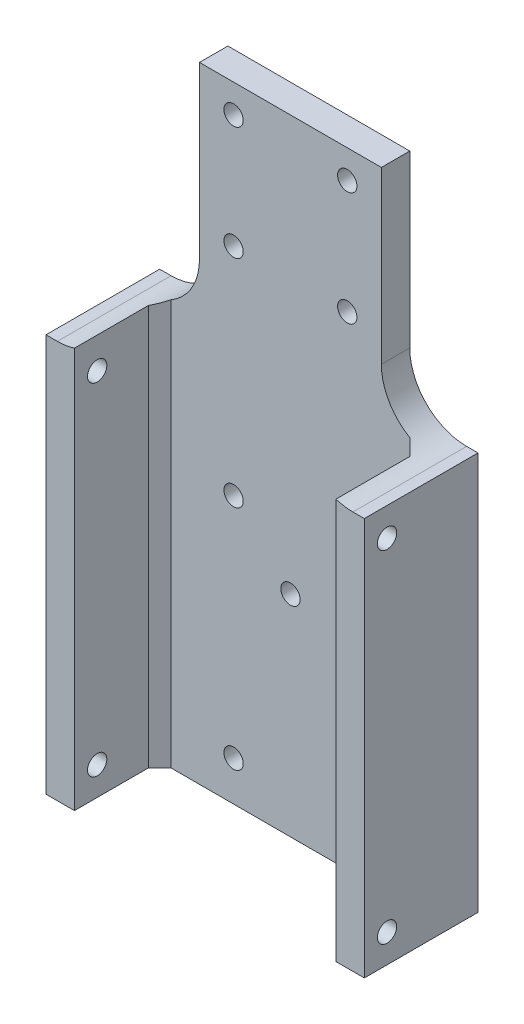
ISO-10303-21;
HEADER;
FILE_DESCRIPTION(('STEP AP214'),'2;1');
FILE_NAME('part.step','',(''),(''),'','','');
FILE_SCHEMA(('AUTOMOTIVE_DESIGN { 1 0 10303 214 1 1 1 1 }'));
ENDSEC;
DATA;
#1=APPLICATION_CONTEXT('core data for automotive mechanical design processes');
#2=APPLICATION_PROTOCOL_DEFINITION('international standard','automotive_design',2000,#1);
#3=PRODUCT_CONTEXT('',#1,'mechanical');
#4=PRODUCT('Part','Part','',(#3));
#5=PRODUCT_RELATED_PRODUCT_CATEGORY('part','',(#4));
#6=PRODUCT_DEFINITION_FORMATION('','',#4);
#7=PRODUCT_DEFINITION_CONTEXT('part definition',#1,'design');
#8=PRODUCT_DEFINITION('design','',#6,#7);
#9=PRODUCT_DEFINITION_SHAPE('','',#8);
#10=(LENGTH_UNIT() NAMED_UNIT(*) SI_UNIT(.MILLI.,.METRE.));
#11=(NAMED_UNIT(*) PLANE_ANGLE_UNIT() SI_UNIT($,.RADIAN.));
#12=(NAMED_UNIT(*) SI_UNIT($,.STERADIAN.) SOLID_ANGLE_UNIT());
#13=UNCERTAINTY_MEASURE_WITH_UNIT(LENGTH_MEASURE(1.E-05),#10,'distance_accuracy_value','');
#14=(GEOMETRIC_REPRESENTATION_CONTEXT(3) GLOBAL_UNCERTAINTY_ASSIGNED_CONTEXT((#13)) GLOBAL_UNIT_ASSIGNED_CONTEXT((#10,
#11,#12)) REPRESENTATION_CONTEXT('',''));
#15=CARTESIAN_POINT('',(0.,0.,0.));
#16=DIRECTION('',(0.,0.,1.));
#17=DIRECTION('',(1.,0.,0.));
#18=AXIS2_PLACEMENT_3D('',#15,#16,#17);
#19=CARTESIAN_POINT('',(-16.,40.,-2.5));
#20=DIRECTION('',(1.,0.,0.));
#21=DIRECTION('',(0.,0.,-1.));
#22=AXIS2_PLACEMENT_3D('',#19,#20,#21);
#23=PLANE('',#22);
#24=DIRECTION('',(0.,-1.,0.));
#25=VECTOR('',#24,1.);
#26=CARTESIAN_POINT('',(-16.,40.,-2.5));
#27=LINE('',#26,#25);
#28=CARTESIAN_POINT('',(-16.,40.,-2.5));
#29=VERTEX_POINT('',#28);
#30=CARTESIAN_POINT('',(-16.,10.,-2.5));
#31=VERTEX_POINT('',#30);
#32=EDGE_CURVE('E251',#29,#31,#27,.T.);
#33=ORIENTED_EDGE('',*,*,#32,.T.);
#34=DIRECTION('',(0.,0.,1.));
#35=VECTOR('',#34,1.);
#36=CARTESIAN_POINT('',(-16.,10.,-2.5));
#37=LINE('',#36,#35);
#38=CARTESIAN_POINT('',(-16.,10.,2.5));
#39=VERTEX_POINT('',#38);
#40=EDGE_CURVE('E262',#31,#39,#37,.T.);
#41=ORIENTED_EDGE('',*,*,#40,.T.);
#42=DIRECTION('',(0.,-1.,0.));
#43=VECTOR('',#42,1.);
#44=CARTESIAN_POINT('',(-16.,40.,2.5));
#45=LINE('',#44,#43);
#46=CARTESIAN_POINT('',(-16.,40.,2.5));
#47=VERTEX_POINT('',#46);
#48=EDGE_CURVE('E259',#47,#39,#45,.T.);
#49=ORIENTED_EDGE('',*,*,#48,.F.);
#50=DIRECTION('',(0.,0.,1.));
#51=VECTOR('',#50,1.);
#52=CARTESIAN_POINT('',(-16.,40.,-2.5));
#53=LINE('',#52,#51);
#54=EDGE_CURVE('E242',#29,#47,#53,.T.);
#55=ORIENTED_EDGE('',*,*,#54,.F.);
#56=EDGE_LOOP('',(#33,#41,#49,#55));
#57=FACE_BOUND('',#56,.T.);
#58=ADVANCED_FACE('F39',(#57),#23,.F.);
#59=CARTESIAN_POINT('',(16.,40.,2.5));
#60=DIRECTION('',(0.,0.,-1.));
#61=DIRECTION('',(-1.,0.,0.));
#62=AXIS2_PLACEMENT_3D('',#59,#60,#61);
#63=PLANE('',#62);
#64=CARTESIAN_POINT('',(9.99999999999997,-23.,2.5));
#65=DIRECTION('',(0.,0.,-1.));
#66=DIRECTION('',(-1.,0.,0.));
#67=AXIS2_PLACEMENT_3D('',#64,#65,#66);
#68=CIRCLE('',#67,1.69999999999999);
#69=CARTESIAN_POINT('',(8.29999999999998,-23.,2.5));
#70=VERTEX_POINT('',#69);
#71=EDGE_CURVE('E272',#70,#70,#68,.T.);
#72=ORIENTED_EDGE('',*,*,#71,.T.);
#73=EDGE_LOOP('',(#72));
#74=FACE_BOUND('',#73,.T.);
#75=CARTESIAN_POINT('',(-10.,-23.,2.5));
#76=DIRECTION('',(0.,0.,-1.));
#77=DIRECTION('',(-1.,0.,0.));
#78=AXIS2_PLACEMENT_3D('',#75,#76,#77);
#79=CIRCLE('',#78,1.69999999999999);
#80=CARTESIAN_POINT('',(-11.7,-23.,2.5));
#81=VERTEX_POINT('',#80);
#82=EDGE_CURVE('E710',#81,#81,#79,.T.);
#83=ORIENTED_EDGE('',*,*,#82,.T.);
#84=EDGE_LOOP('',(#83));
#85=FACE_BOUND('',#84,.T.);
#86=CARTESIAN_POINT('',(0.,-33.,2.5));
#87=DIRECTION('',(0.,0.,-1.));
#88=DIRECTION('',(-1.,0.,0.));
#89=AXIS2_PLACEMENT_3D('',#86,#87,#88);
#90=CIRCLE('',#89,1.69999999999999);
#91=CARTESIAN_POINT('',(-1.70000000000002,-33.,2.5));
#92=VERTEX_POINT('',#91);
#93=EDGE_CURVE('E704',#92,#92,#90,.T.);
#94=ORIENTED_EDGE('',*,*,#93,.T.);
#95=EDGE_LOOP('',(#94));
#96=FACE_BOUND('',#95,.T.);
#97=CARTESIAN_POINT('',(9.99999999999997,-63.,2.5));
#98=DIRECTION('',(0.,0.,-1.));
#99=DIRECTION('',(-1.,0.,0.));
#100=AXIS2_PLACEMENT_3D('',#97,#98,#99);
#101=CIRCLE('',#100,1.69999999999999);
#102=CARTESIAN_POINT('',(8.29999999999998,-63.,2.5));
#103=VERTEX_POINT('',#102);
#104=EDGE_CURVE('E698',#103,#103,#101,.T.);
#105=ORIENTED_EDGE('',*,*,#104,.T.);
#106=EDGE_LOOP('',(#105));
#107=FACE_BOUND('',#106,.T.);
#108=CARTESIAN_POINT('',(-10.,-63.,2.5));
#109=DIRECTION('',(0.,0.,-1.));
#110=DIRECTION('',(-1.,0.,0.));
#111=AXIS2_PLACEMENT_3D('',#108,#109,#110);
#112=CIRCLE('',#111,1.69999999999999);
#113=CARTESIAN_POINT('',(-11.7,-63.,2.5));
#114=VERTEX_POINT('',#113);
#115=EDGE_CURVE('E679',#114,#114,#112,.T.);
#116=ORIENTED_EDGE('',*,*,#115,.T.);
#117=EDGE_LOOP('',(#116));
#118=FACE_BOUND('',#117,.T.);
#119=CARTESIAN_POINT('',(-9.99999999999998,35.,2.5));
#120=DIRECTION('',(0.,0.,1.));
#121=DIRECTION('',(1.,0.,0.));
#122=AXIS2_PLACEMENT_3D('',#119,#120,#121);
#123=CIRCLE('',#122,1.7);
#124=CARTESIAN_POINT('',(-8.29999999999998,35.,2.5));
#125=VERTEX_POINT('',#124);
#126=EDGE_CURVE('E164',#125,#125,#123,.T.);
#127=ORIENTED_EDGE('',*,*,#126,.F.);
#128=EDGE_LOOP('',(#127));
#129=FACE_BOUND('',#128,.T.);
#130=CARTESIAN_POINT('',(10.,35.,2.5));
#131=DIRECTION('',(0.,0.,1.));
#132=DIRECTION('',(1.,0.,0.));
#133=AXIS2_PLACEMENT_3D('',#130,#131,#132);
#134=CIRCLE('',#133,1.7);
#135=CARTESIAN_POINT('',(11.7,35.,2.5));
#136=VERTEX_POINT('',#135);
#137=EDGE_CURVE('E224',#136,#136,#134,.T.);
#138=ORIENTED_EDGE('',*,*,#137,.F.);
#139=EDGE_LOOP('',(#138));
#140=FACE_BOUND('',#139,.T.);
#141=CARTESIAN_POINT('',(9.99999999999998,15.,2.5));
#142=DIRECTION('',(0.,0.,1.));
#143=DIRECTION('',(1.,0.,0.));
#144=AXIS2_PLACEMENT_3D('',#141,#142,#143);
#145=CIRCLE('',#144,1.7);
#146=CARTESIAN_POINT('',(11.7,15.,2.5));
#147=VERTEX_POINT('',#146);
#148=EDGE_CURVE('E230',#147,#147,#145,.T.);
#149=ORIENTED_EDGE('',*,*,#148,.F.);
#150=EDGE_LOOP('',(#149));
#151=FACE_BOUND('',#150,.T.);
#152=CARTESIAN_POINT('',(-9.99999999999998,15.,2.5));
#153=DIRECTION('',(0.,0.,1.));
#154=DIRECTION('',(1.,0.,0.));
#155=AXIS2_PLACEMENT_3D('',#152,#153,#154);
#156=CIRCLE('',#155,1.7);
#157=CARTESIAN_POINT('',(-8.29999999999998,15.,2.5));
#158=VERTEX_POINT('',#157);
#159=EDGE_CURVE('E236',#158,#158,#156,.T.);
#160=ORIENTED_EDGE('',*,*,#159,.F.);
#161=EDGE_LOOP('',(#160));
#162=FACE_BOUND('',#161,.T.);
#163=DIRECTION('',(1.,0.,0.));
#164=VECTOR('',#163,1.);
#165=CARTESIAN_POINT('',(-23.,-70.,2.5));
#166=LINE('',#165,#164);
#167=CARTESIAN_POINT('',(-21.,-70.,2.5));
#168=VERTEX_POINT('',#167);
#169=CARTESIAN_POINT('',(21.,-70.,2.5));
#170=VERTEX_POINT('',#169);
#171=EDGE_CURVE('E165',#168,#170,#166,.T.);
#172=ORIENTED_EDGE('',*,*,#171,.T.);
#173=DIRECTION('',(0.,1.,0.));
#174=VECTOR('',#173,1.);
#175=CARTESIAN_POINT('',(21.,40.,2.5));
#176=LINE('',#175,#174);
#177=CARTESIAN_POINT('',(21.,1.33974596215561,2.5));
#178=VERTEX_POINT('',#177);
#179=EDGE_CURVE('E307',#170,#178,#176,.T.);
#180=ORIENTED_EDGE('',*,*,#179,.T.);
#181=CARTESIAN_POINT('',(26.,10.,2.5));
#182=DIRECTION('',(0.,0.,-1.));
#183=DIRECTION('',(-1.,0.,0.));
#184=AXIS2_PLACEMENT_3D('',#181,#182,#183);
#185=CIRCLE('',#184,10.);
#186=CARTESIAN_POINT('',(16.,10.,2.5));
#187=VERTEX_POINT('',#186);
#188=EDGE_CURVE('E303',#178,#187,#185,.T.);
#189=ORIENTED_EDGE('',*,*,#188,.T.);
#190=DIRECTION('',(0.,-1.,0.));
#191=VECTOR('',#190,1.);
#192=CARTESIAN_POINT('',(16.,40.,2.5));
#193=LINE('',#192,#191);
#194=CARTESIAN_POINT('',(16.,40.,2.5));
#195=VERTEX_POINT('',#194);
#196=EDGE_CURVE('E256',#195,#187,#193,.T.);
#197=ORIENTED_EDGE('',*,*,#196,.F.);
#198=DIRECTION('',(1.,0.,0.));
#199=VECTOR('',#198,1.);
#200=CARTESIAN_POINT('',(16.,40.,2.5));
#201=LINE('',#200,#199);
#202=EDGE_CURVE('E245',#47,#195,#201,.T.);
#203=ORIENTED_EDGE('',*,*,#202,.F.);
#204=ORIENTED_EDGE('',*,*,#48,.T.);
#205=CARTESIAN_POINT('',(-26.,10.,2.5));
#206=DIRECTION('',(0.,0.,-1.));
#207=DIRECTION('',(-1.,0.,0.));
#208=AXIS2_PLACEMENT_3D('',#205,#206,#207);
#209=CIRCLE('',#208,10.);
#210=CARTESIAN_POINT('',(-21.,1.33974596215562,2.5));
#211=VERTEX_POINT('',#210);
#212=EDGE_CURVE('E286',#39,#211,#209,.T.);
#213=ORIENTED_EDGE('',*,*,#212,.T.);
#214=DIRECTION('',(0.,-1.,0.));
#215=VECTOR('',#214,1.);
#216=CARTESIAN_POINT('',(-21.,40.,2.5));
#217=LINE('',#216,#215);
#218=EDGE_CURVE('E305',#211,#168,#217,.T.);
#219=ORIENTED_EDGE('',*,*,#218,.T.);
#220=EDGE_LOOP('',(#172,#180,#189,#197,#203,#204,#213,#219));
#221=FACE_BOUND('',#220,.T.);
#222=ADVANCED_FACE('F324',(#74,#85,#96,#107,#118,#129,#140,#151,#162,#221),#63,.F.);
#223=CARTESIAN_POINT('',(16.,40.,-2.5));
#224=DIRECTION('',(-1.,0.,0.));
#225=DIRECTION('',(0.,0.,1.));
#226=AXIS2_PLACEMENT_3D('',#223,#224,#225);
#227=PLANE('',#226);
#228=ORIENTED_EDGE('',*,*,#196,.T.);
#229=DIRECTION('',(0.,0.,-1.));
#230=VECTOR('',#229,1.);
#231=CARTESIAN_POINT('',(16.,10.,-2.5));
#232=LINE('',#231,#230);
#233=CARTESIAN_POINT('',(16.,10.,-2.5));
#234=VERTEX_POINT('',#233);
#235=EDGE_CURVE('E281',#187,#234,#232,.T.);
#236=ORIENTED_EDGE('',*,*,#235,.T.);
#237=DIRECTION('',(0.,-1.,0.));
#238=VECTOR('',#237,1.);
#239=CARTESIAN_POINT('',(16.,40.,-2.5));
#240=LINE('',#239,#238);
#241=CARTESIAN_POINT('',(16.,40.,-2.5));
#242=VERTEX_POINT('',#241);
#243=EDGE_CURVE('E254',#242,#234,#240,.T.);
#244=ORIENTED_EDGE('',*,*,#243,.F.);
#245=DIRECTION('',(0.,0.,-1.));
#246=VECTOR('',#245,1.);
#247=CARTESIAN_POINT('',(16.,40.,-2.5));
#248=LINE('',#247,#246);
#249=EDGE_CURVE('E247',#195,#242,#248,.T.);
#250=ORIENTED_EDGE('',*,*,#249,.F.);
#251=EDGE_LOOP('',(#228,#236,#244,#250));
#252=FACE_BOUND('',#251,.T.);
#253=ADVANCED_FACE('F344',(#252),#227,.F.);
#254=CARTESIAN_POINT('',(16.,40.,-2.5));
#255=DIRECTION('',(0.,0.,1.));
#256=DIRECTION('',(1.,0.,0.));
#257=AXIS2_PLACEMENT_3D('',#254,#255,#256);
#258=PLANE('',#257);
#259=CARTESIAN_POINT('',(9.99999999999997,-23.,-2.5));
#260=DIRECTION('',(0.,0.,-1.));
#261=DIRECTION('',(-1.,0.,0.));
#262=AXIS2_PLACEMENT_3D('',#259,#260,#261);
#263=CIRCLE('',#262,1.69999999999999);
#264=CARTESIAN_POINT('',(8.29999999999999,-23.,-2.5));
#265=VERTEX_POINT('',#264);
#266=EDGE_CURVE('E276',#265,#265,#263,.T.);
#267=ORIENTED_EDGE('',*,*,#266,.F.);
#268=EDGE_LOOP('',(#267));
#269=FACE_BOUND('',#268,.T.);
#270=CARTESIAN_POINT('',(-10.,-23.,-2.5));
#271=DIRECTION('',(0.,0.,-1.));
#272=DIRECTION('',(-1.,0.,0.));
#273=AXIS2_PLACEMENT_3D('',#270,#271,#272);
#274=CIRCLE('',#273,1.69999999999999);
#275=CARTESIAN_POINT('',(-11.7,-23.,-2.5));
#276=VERTEX_POINT('',#275);
#277=EDGE_CURVE('E275',#276,#276,#274,.T.);
#278=ORIENTED_EDGE('',*,*,#277,.F.);
#279=EDGE_LOOP('',(#278));
#280=FACE_BOUND('',#279,.T.);
#281=CARTESIAN_POINT('',(0.,-33.,-2.5));
#282=DIRECTION('',(0.,0.,-1.));
#283=DIRECTION('',(-1.,0.,0.));
#284=AXIS2_PLACEMENT_3D('',#281,#282,#283);
#285=CIRCLE('',#284,1.69999999999999);
#286=CARTESIAN_POINT('',(-1.70000000000001,-33.,-2.5));
#287=VERTEX_POINT('',#286);
#288=EDGE_CURVE('E707',#287,#287,#285,.T.);
#289=ORIENTED_EDGE('',*,*,#288,.F.);
#290=EDGE_LOOP('',(#289));
#291=FACE_BOUND('',#290,.T.);
#292=CARTESIAN_POINT('',(9.99999999999997,-63.,-2.5));
#293=DIRECTION('',(0.,0.,-1.));
#294=DIRECTION('',(-1.,0.,0.));
#295=AXIS2_PLACEMENT_3D('',#292,#293,#294);
#296=CIRCLE('',#295,1.69999999999999);
#297=CARTESIAN_POINT('',(8.29999999999999,-63.,-2.5));
#298=VERTEX_POINT('',#297);
#299=EDGE_CURVE('E701',#298,#298,#296,.T.);
#300=ORIENTED_EDGE('',*,*,#299,.F.);
#301=EDGE_LOOP('',(#300));
#302=FACE_BOUND('',#301,.T.);
#303=CARTESIAN_POINT('',(-10.,-63.,-2.5));
#304=DIRECTION('',(0.,0.,-1.));
#305=DIRECTION('',(-1.,0.,0.));
#306=AXIS2_PLACEMENT_3D('',#303,#304,#305);
#307=CIRCLE('',#306,1.69999999999999);
#308=CARTESIAN_POINT('',(-11.7,-63.,-2.5));
#309=VERTEX_POINT('',#308);
#310=EDGE_CURVE('E695',#309,#309,#307,.T.);
#311=ORIENTED_EDGE('',*,*,#310,.F.);
#312=EDGE_LOOP('',(#311));
#313=FACE_BOUND('',#312,.T.);
#314=CARTESIAN_POINT('',(-9.99999999999998,35.,-2.5));
#315=DIRECTION('',(0.,0.,1.));
#316=DIRECTION('',(1.,0.,0.));
#317=AXIS2_PLACEMENT_3D('',#314,#315,#316);
#318=CIRCLE('',#317,1.7);
#319=CARTESIAN_POINT('',(-8.29999999999998,35.,-2.5));
#320=VERTEX_POINT('',#319);
#321=EDGE_CURVE('E221',#320,#320,#318,.T.);
#322=ORIENTED_EDGE('',*,*,#321,.T.);
#323=EDGE_LOOP('',(#322));
#324=FACE_BOUND('',#323,.T.);
#325=CARTESIAN_POINT('',(10.,35.,-2.5));
#326=DIRECTION('',(0.,0.,1.));
#327=DIRECTION('',(1.,0.,0.));
#328=AXIS2_PLACEMENT_3D('',#325,#326,#327);
#329=CIRCLE('',#328,1.7);
#330=CARTESIAN_POINT('',(11.7,35.,-2.5));
#331=VERTEX_POINT('',#330);
#332=EDGE_CURVE('E227',#331,#331,#329,.T.);
#333=ORIENTED_EDGE('',*,*,#332,.T.);
#334=EDGE_LOOP('',(#333));
#335=FACE_BOUND('',#334,.T.);
#336=CARTESIAN_POINT('',(9.99999999999998,15.,-2.5));
#337=DIRECTION('',(0.,0.,1.));
#338=DIRECTION('',(1.,0.,0.));
#339=AXIS2_PLACEMENT_3D('',#336,#337,#338);
#340=CIRCLE('',#339,1.7);
#341=CARTESIAN_POINT('',(11.7,15.,-2.5));
#342=VERTEX_POINT('',#341);
#343=EDGE_CURVE('E233',#342,#342,#340,.T.);
#344=ORIENTED_EDGE('',*,*,#343,.T.);
#345=EDGE_LOOP('',(#344));
#346=FACE_BOUND('',#345,.T.);
#347=CARTESIAN_POINT('',(-9.99999999999998,15.,-2.5));
#348=DIRECTION('',(0.,0.,1.));
#349=DIRECTION('',(1.,0.,0.));
#350=AXIS2_PLACEMENT_3D('',#347,#348,#349);
#351=CIRCLE('',#350,1.7);
#352=CARTESIAN_POINT('',(-8.29999999999998,15.,-2.5));
#353=VERTEX_POINT('',#352);
#354=EDGE_CURVE('E239',#353,#353,#351,.T.);
#355=ORIENTED_EDGE('',*,*,#354,.T.);
#356=EDGE_LOOP('',(#355));
#357=FACE_BOUND('',#356,.T.);
#358=ORIENTED_EDGE('',*,*,#243,.T.);
#359=CARTESIAN_POINT('',(26.,10.,-2.5));
#360=DIRECTION('',(0.,0.,1.));
#361=DIRECTION('',(1.,0.,0.));
#362=AXIS2_PLACEMENT_3D('',#359,#360,#361);
#363=CIRCLE('',#362,10.);
#364=CARTESIAN_POINT('',(26.,0.,-2.5));
#365=VERTEX_POINT('',#364);
#366=EDGE_CURVE('E295',#234,#365,#363,.T.);
#367=ORIENTED_EDGE('',*,*,#366,.T.);
#368=DIRECTION('',(-1.,0.,0.));
#369=VECTOR('',#368,1.);
#370=CARTESIAN_POINT('',(-23.,0.,-2.5));
#371=LINE('',#370,#369);
#372=CARTESIAN_POINT('',(28.,0.,-2.5));
#373=VERTEX_POINT('',#372);
#374=EDGE_CURVE('E215',#373,#365,#371,.T.);
#375=ORIENTED_EDGE('',*,*,#374,.F.);
#376=DIRECTION('',(0.,1.,0.));
#377=VECTOR('',#376,1.);
#378=CARTESIAN_POINT('',(28.,-70.,-2.5));
#379=LINE('',#378,#377);
#380=CARTESIAN_POINT('',(28.,-70.,-2.5));
#381=VERTEX_POINT('',#380);
#382=EDGE_CURVE('E160',#381,#373,#379,.T.);
#383=ORIENTED_EDGE('',*,*,#382,.F.);
#384=DIRECTION('',(-1.,0.,0.));
#385=VECTOR('',#384,1.);
#386=CARTESIAN_POINT('',(-23.,-70.,-2.5));
#387=LINE('',#386,#385);
#388=CARTESIAN_POINT('',(-28.,-70.,-2.5));
#389=VERTEX_POINT('',#388);
#390=EDGE_CURVE('E152',#381,#389,#387,.T.);
#391=ORIENTED_EDGE('',*,*,#390,.T.);
#392=DIRECTION('',(0.,1.,0.));
#393=VECTOR('',#392,1.);
#394=CARTESIAN_POINT('',(-28.,-70.,-2.5));
#395=LINE('',#394,#393);
#396=CARTESIAN_POINT('',(-28.,0.,-2.5));
#397=VERTEX_POINT('',#396);
#398=EDGE_CURVE('E157',#389,#397,#395,.T.);
#399=ORIENTED_EDGE('',*,*,#398,.T.);
#400=CARTESIAN_POINT('',(-26.,0.,-2.5));
#401=VERTEX_POINT('',#400);
#402=EDGE_CURVE('E209',#401,#397,#371,.T.);
#403=ORIENTED_EDGE('',*,*,#402,.F.);
#404=CARTESIAN_POINT('',(-26.,10.,-2.5));
#405=DIRECTION('',(0.,0.,1.));
#406=DIRECTION('',(1.,0.,0.));
#407=AXIS2_PLACEMENT_3D('',#404,#405,#406);
#408=CIRCLE('',#407,10.);
#409=EDGE_CURVE('E293',#401,#31,#408,.T.);
#410=ORIENTED_EDGE('',*,*,#409,.T.);
#411=ORIENTED_EDGE('',*,*,#32,.F.);
#412=DIRECTION('',(-1.,0.,0.));
#413=VECTOR('',#412,1.);
#414=CARTESIAN_POINT('',(16.,40.,-2.5));
#415=LINE('',#414,#413);
#416=EDGE_CURVE('E249',#242,#29,#415,.T.);
#417=ORIENTED_EDGE('',*,*,#416,.F.);
#418=EDGE_LOOP('',(#358,#367,#375,#383,#391,#399,#403,#410,#411,#417));
#419=FACE_BOUND('',#418,.T.);
#420=ADVANCED_FACE('F155',(#269,#280,#291,#302,#313,#324,#335,#346,#357,#419),#258,.F.);
#421=CARTESIAN_POINT('',(0.,40.,0.));
#422=DIRECTION('',(0.,-1.,0.));
#423=DIRECTION('',(0.,0.,-1.));
#424=AXIS2_PLACEMENT_3D('',#421,#422,#423);
#425=PLANE('',#424);
#426=ORIENTED_EDGE('',*,*,#54,.T.);
#427=ORIENTED_EDGE('',*,*,#202,.T.);
#428=ORIENTED_EDGE('',*,*,#249,.T.);
#429=ORIENTED_EDGE('',*,*,#416,.T.);
#430=EDGE_LOOP('',(#426,#427,#428,#429));
#431=FACE_BOUND('',#430,.T.);
#432=ADVANCED_FACE('F340',(#431),#425,.F.);
#433=CARTESIAN_POINT('',(-9.99999999999998,15.,2.5));
#434=DIRECTION('',(0.,0.,1.));
#435=DIRECTION('',(1.,0.,0.));
#436=AXIS2_PLACEMENT_3D('',#433,#434,#435);
#437=CYLINDRICAL_SURFACE('',#436,1.7);
#438=ORIENTED_EDGE('',*,*,#354,.F.);
#439=EDGE_LOOP('',(#438));
#440=FACE_BOUND('',#439,.T.);
#441=ORIENTED_EDGE('',*,*,#159,.T.);
#442=EDGE_LOOP('',(#441));
#443=FACE_BOUND('',#442,.T.);
#444=ADVANCED_FACE('F454',(#440,#443),#437,.F.);
#445=CARTESIAN_POINT('',(9.99999999999998,15.,2.5));
#446=DIRECTION('',(0.,0.,1.));
#447=DIRECTION('',(1.,0.,0.));
#448=AXIS2_PLACEMENT_3D('',#445,#446,#447);
#449=CYLINDRICAL_SURFACE('',#448,1.7);
#450=ORIENTED_EDGE('',*,*,#343,.F.);
#451=EDGE_LOOP('',(#450));
#452=FACE_BOUND('',#451,.T.);
#453=ORIENTED_EDGE('',*,*,#148,.T.);
#454=EDGE_LOOP('',(#453));
#455=FACE_BOUND('',#454,.T.);
#456=ADVANCED_FACE('F450',(#452,#455),#449,.F.);
#457=CARTESIAN_POINT('',(10.,35.,2.5));
#458=DIRECTION('',(0.,0.,1.));
#459=DIRECTION('',(1.,0.,0.));
#460=AXIS2_PLACEMENT_3D('',#457,#458,#459);
#461=CYLINDRICAL_SURFACE('',#460,1.7);
#462=ORIENTED_EDGE('',*,*,#332,.F.);
#463=EDGE_LOOP('',(#462));
#464=FACE_BOUND('',#463,.T.);
#465=ORIENTED_EDGE('',*,*,#137,.T.);
#466=EDGE_LOOP('',(#465));
#467=FACE_BOUND('',#466,.T.);
#468=ADVANCED_FACE('F446',(#464,#467),#461,.F.);
#469=CARTESIAN_POINT('',(-9.99999999999998,35.,2.5));
#470=DIRECTION('',(0.,0.,1.));
#471=DIRECTION('',(1.,0.,0.));
#472=AXIS2_PLACEMENT_3D('',#469,#470,#471);
#473=CYLINDRICAL_SURFACE('',#472,1.7);
#474=ORIENTED_EDGE('',*,*,#321,.F.);
#475=EDGE_LOOP('',(#474));
#476=FACE_BOUND('',#475,.T.);
#477=ORIENTED_EDGE('',*,*,#126,.T.);
#478=EDGE_LOOP('',(#477));
#479=FACE_BOUND('',#478,.T.);
#480=ADVANCED_FACE('F443',(#476,#479),#473,.F.);
#481=CARTESIAN_POINT('',(0.,0.,0.));
#482=DIRECTION('',(0.,1.,0.));
#483=DIRECTION('',(0.,0.,1.));
#484=AXIS2_PLACEMENT_3D('',#481,#482,#483);
#485=PLANE('',#484);
#486=DIRECTION('',(1.,0.,0.));
#487=VECTOR('',#486,1.);
#488=CARTESIAN_POINT('',(-23.,0.,17.5));
#489=LINE('',#488,#487);
#490=CARTESIAN_POINT('',(-28.,0.,17.5));
#491=VERTEX_POINT('',#490);
#492=CARTESIAN_POINT('',(-26.,0.,17.5));
#493=VERTEX_POINT('',#492);
#494=EDGE_CURVE('E180',#491,#493,#489,.T.);
#495=ORIENTED_EDGE('',*,*,#494,.T.);
#496=DIRECTION('',(0.,0.,1.));
#497=VECTOR('',#496,1.);
#498=CARTESIAN_POINT('',(-26.,0.,0.));
#499=LINE('',#498,#497);
#500=EDGE_CURVE('E279',#493,#401,#499,.F.);
#501=ORIENTED_EDGE('',*,*,#500,.T.);
#502=ORIENTED_EDGE('',*,*,#402,.T.);
#503=DIRECTION('',(0.,0.,1.));
#504=VECTOR('',#503,1.);
#505=CARTESIAN_POINT('',(-28.,0.,-2.5));
#506=LINE('',#505,#504);
#507=EDGE_CURVE('E172',#397,#491,#506,.T.);
#508=ORIENTED_EDGE('',*,*,#507,.T.);
#509=EDGE_LOOP('',(#495,#501,#502,#508));
#510=FACE_BOUND('',#509,.T.);
#511=ADVANCED_FACE('F333',(#510),#485,.T.);
#512=ORIENTED_EDGE('',*,*,#374,.T.);
#513=DIRECTION('',(0.,0.,-1.));
#514=VECTOR('',#513,1.);
#515=CARTESIAN_POINT('',(26.,0.,0.));
#516=LINE('',#515,#514);
#517=CARTESIAN_POINT('',(26.,0.,17.5));
#518=VERTEX_POINT('',#517);
#519=EDGE_CURVE('E284',#365,#518,#516,.F.);
#520=ORIENTED_EDGE('',*,*,#519,.T.);
#521=DIRECTION('',(1.,0.,0.));
#522=VECTOR('',#521,1.);
#523=CARTESIAN_POINT('',(23.,0.,17.5));
#524=LINE('',#523,#522);
#525=CARTESIAN_POINT('',(28.,0.,17.5));
#526=VERTEX_POINT('',#525);
#527=EDGE_CURVE('E194',#518,#526,#524,.T.);
#528=ORIENTED_EDGE('',*,*,#527,.T.);
#529=DIRECTION('',(0.,0.,-1.));
#530=VECTOR('',#529,1.);
#531=CARTESIAN_POINT('',(28.,0.,-2.5));
#532=LINE('',#531,#530);
#533=EDGE_CURVE('E199',#526,#373,#532,.T.);
#534=ORIENTED_EDGE('',*,*,#533,.T.);
#535=EDGE_LOOP('',(#512,#520,#528,#534));
#536=FACE_BOUND('',#535,.T.);
#537=ADVANCED_FACE('F352',(#536),#485,.T.);
#538=CARTESIAN_POINT('',(0.,-70.,0.));
#539=DIRECTION('',(0.,1.,0.));
#540=DIRECTION('',(0.,0.,1.));
#541=AXIS2_PLACEMENT_3D('',#538,#539,#540);
#542=PLANE('',#541);
#543=ORIENTED_EDGE('',*,*,#171,.F.);
#544=DIRECTION('',(-0.707106781186549,0.,0.707106781186546));
#545=VECTOR('',#544,1.);
#546=CARTESIAN_POINT('',(-9.24999999999996,-70.,-9.24999999999999));
#547=LINE('',#546,#545);
#548=CARTESIAN_POINT('',(-23.,-70.,4.5));
#549=VERTEX_POINT('',#548);
#550=EDGE_CURVE('E13',#168,#549,#547,.T.);
#551=ORIENTED_EDGE('',*,*,#550,.T.);
#552=DIRECTION('',(0.,0.,-1.));
#553=VECTOR('',#552,1.);
#554=CARTESIAN_POINT('',(-23.,-70.,-2.5));
#555=LINE('',#554,#553);
#556=CARTESIAN_POINT('',(-23.,-70.,17.5));
#557=VERTEX_POINT('',#556);
#558=EDGE_CURVE('E174',#557,#549,#555,.T.);
#559=ORIENTED_EDGE('',*,*,#558,.F.);
#560=DIRECTION('',(1.,0.,0.));
#561=VECTOR('',#560,1.);
#562=CARTESIAN_POINT('',(-23.,-70.,17.5));
#563=LINE('',#562,#561);
#564=CARTESIAN_POINT('',(-28.,-70.,17.5));
#565=VERTEX_POINT('',#564);
#566=EDGE_CURVE('E179',#565,#557,#563,.T.);
#567=ORIENTED_EDGE('',*,*,#566,.F.);
#568=DIRECTION('',(0.,0.,1.));
#569=VECTOR('',#568,1.);
#570=CARTESIAN_POINT('',(-28.,-70.,-2.5));
#571=LINE('',#570,#569);
#572=EDGE_CURVE('E170',#389,#565,#571,.T.);
#573=ORIENTED_EDGE('',*,*,#572,.F.);
#574=ORIENTED_EDGE('',*,*,#390,.F.);
#575=DIRECTION('',(0.,0.,-1.));
#576=VECTOR('',#575,1.);
#577=CARTESIAN_POINT('',(28.,-70.,-2.5));
#578=LINE('',#577,#576);
#579=CARTESIAN_POINT('',(28.,-70.,17.5));
#580=VERTEX_POINT('',#579);
#581=EDGE_CURVE('E202',#580,#381,#578,.T.);
#582=ORIENTED_EDGE('',*,*,#581,.F.);
#583=DIRECTION('',(1.,0.,0.));
#584=VECTOR('',#583,1.);
#585=CARTESIAN_POINT('',(23.,-70.,17.5));
#586=LINE('',#585,#584);
#587=CARTESIAN_POINT('',(23.,-70.,17.5));
#588=VERTEX_POINT('',#587);
#589=EDGE_CURVE('E198',#588,#580,#586,.T.);
#590=ORIENTED_EDGE('',*,*,#589,.F.);
#591=DIRECTION('',(0.,0.,1.));
#592=VECTOR('',#591,1.);
#593=CARTESIAN_POINT('',(23.,-70.,-2.5));
#594=LINE('',#593,#592);
#595=CARTESIAN_POINT('',(23.,-70.,4.5));
#596=VERTEX_POINT('',#595);
#597=EDGE_CURVE('E196',#596,#588,#594,.T.);
#598=ORIENTED_EDGE('',*,*,#597,.F.);
#599=DIRECTION('',(-0.707106781186548,0.,-0.707106781186547));
#600=VECTOR('',#599,1.);
#601=CARTESIAN_POINT('',(9.24999999999998,-70.,-9.25));
#602=LINE('',#601,#600);
#603=EDGE_CURVE('E316',#596,#170,#602,.T.);
#604=ORIENTED_EDGE('',*,*,#603,.T.);
#605=EDGE_LOOP('',(#543,#551,#559,#567,#573,#574,#582,#590,#598,#604));
#606=FACE_BOUND('',#605,.T.);
#607=ADVANCED_FACE('F177',(#606),#542,.F.);
#608=CARTESIAN_POINT('',(23.,-70.,-2.5));
#609=DIRECTION('',(-1.,0.,0.));
#610=DIRECTION('',(0.,0.,1.));
#611=AXIS2_PLACEMENT_3D('',#608,#609,#610);
#612=PLANE('',#611);
#613=CARTESIAN_POINT('',(23.,-5.,13.5));
#614=DIRECTION('',(-1.,0.,0.));
#615=DIRECTION('',(0.,0.,1.));
#616=AXIS2_PLACEMENT_3D('',#613,#614,#615);
#617=CIRCLE('',#616,1.69999999999999);
#618=CARTESIAN_POINT('',(23.,-5.,15.2));
#619=VERTEX_POINT('',#618);
#620=EDGE_CURVE('E267',#619,#619,#617,.T.);
#621=ORIENTED_EDGE('',*,*,#620,.F.);
#622=EDGE_LOOP('',(#621));
#623=FACE_BOUND('',#622,.T.);
#624=CARTESIAN_POINT('',(23.,-65.,13.5));
#625=DIRECTION('',(-1.,0.,0.));
#626=DIRECTION('',(0.,0.,1.));
#627=AXIS2_PLACEMENT_3D('',#624,#625,#626);
#628=CIRCLE('',#627,1.69999999999999);
#629=CARTESIAN_POINT('',(23.,-65.,15.2));
#630=VERTEX_POINT('',#629);
#631=EDGE_CURVE('E186',#630,#630,#628,.T.);
#632=ORIENTED_EDGE('',*,*,#631,.F.);
#633=EDGE_LOOP('',(#632));
#634=FACE_BOUND('',#633,.T.);
#635=DIRECTION('',(0.,0.,-1.));
#636=VECTOR('',#635,1.);
#637=CARTESIAN_POINT('',(23.,0.460607985830526,17.5));
#638=LINE('',#637,#636);
#639=CARTESIAN_POINT('',(23.,0.46060798583053,17.5));
#640=VERTEX_POINT('',#639);
#641=CARTESIAN_POINT('',(23.,0.460607985830526,4.5));
#642=VERTEX_POINT('',#641);
#643=EDGE_CURVE('E300',#640,#642,#638,.T.);
#644=ORIENTED_EDGE('',*,*,#643,.T.);
#645=DIRECTION('',(0.,-1.,0.));
#646=VECTOR('',#645,1.);
#647=CARTESIAN_POINT('',(23.,-70.,4.5));
#648=LINE('',#647,#646);
#649=EDGE_CURVE('E310',#642,#596,#648,.T.);
#650=ORIENTED_EDGE('',*,*,#649,.T.);
#651=ORIENTED_EDGE('',*,*,#597,.T.);
#652=DIRECTION('',(0.,1.,0.));
#653=VECTOR('',#652,1.);
#654=CARTESIAN_POINT('',(23.,-70.,17.5));
#655=LINE('',#654,#653);
#656=EDGE_CURVE('E204',#588,#640,#655,.T.);
#657=ORIENTED_EDGE('',*,*,#656,.T.);
#658=EDGE_LOOP('',(#644,#650,#651,#657));
#659=FACE_BOUND('',#658,.T.);
#660=ADVANCED_FACE('F364',(#623,#634,#659),#612,.T.);
#661=CARTESIAN_POINT('',(28.,-70.,-2.5));
#662=DIRECTION('',(1.,0.,0.));
#663=DIRECTION('',(0.,0.,-1.));
#664=AXIS2_PLACEMENT_3D('',#661,#662,#663);
#665=PLANE('',#664);
#666=CARTESIAN_POINT('',(28.,-5.,13.5));
#667=DIRECTION('',(1.,0.,0.));
#668=DIRECTION('',(0.,0.,-1.));
#669=AXIS2_PLACEMENT_3D('',#666,#667,#668);
#670=CIRCLE('',#669,1.7);
#671=CARTESIAN_POINT('',(28.,-5.,11.8));
#672=VERTEX_POINT('',#671);
#673=EDGE_CURVE('E676',#672,#672,#670,.T.);
#674=ORIENTED_EDGE('',*,*,#673,.F.);
#675=EDGE_LOOP('',(#674));
#676=FACE_BOUND('',#675,.T.);
#677=CARTESIAN_POINT('',(28.,-65.,13.5));
#678=DIRECTION('',(1.,0.,0.));
#679=DIRECTION('',(0.,0.,-1.));
#680=AXIS2_PLACEMENT_3D('',#677,#678,#679);
#681=CIRCLE('',#680,1.69999999999999);
#682=CARTESIAN_POINT('',(28.,-65.,11.8));
#683=VERTEX_POINT('',#682);
#684=EDGE_CURVE('E684',#683,#683,#681,.T.);
#685=ORIENTED_EDGE('',*,*,#684,.F.);
#686=EDGE_LOOP('',(#685));
#687=FACE_BOUND('',#686,.T.);
#688=ORIENTED_EDGE('',*,*,#533,.F.);
#689=DIRECTION('',(0.,1.,0.));
#690=VECTOR('',#689,1.);
#691=CARTESIAN_POINT('',(28.,-70.,17.5));
#692=LINE('',#691,#690);
#693=EDGE_CURVE('E210',#580,#526,#692,.T.);
#694=ORIENTED_EDGE('',*,*,#693,.F.);
#695=ORIENTED_EDGE('',*,*,#581,.T.);
#696=ORIENTED_EDGE('',*,*,#382,.T.);
#697=EDGE_LOOP('',(#688,#694,#695,#696));
#698=FACE_BOUND('',#697,.T.);
#699=ADVANCED_FACE('F356',(#676,#687,#698),#665,.T.);
#700=CARTESIAN_POINT('',(23.,-70.,17.5));
#701=DIRECTION('',(0.,0.,1.));
#702=DIRECTION('',(1.,0.,0.));
#703=AXIS2_PLACEMENT_3D('',#700,#701,#702);
#704=PLANE('',#703);
#705=ORIENTED_EDGE('',*,*,#527,.F.);
#706=CARTESIAN_POINT('',(26.,10.,17.5));
#707=DIRECTION('',(0.,0.,1.));
#708=DIRECTION('',(1.,0.,0.));
#709=AXIS2_PLACEMENT_3D('',#706,#707,#708);
#710=CIRCLE('',#709,10.);
#711=EDGE_CURVE('E297',#518,#640,#710,.F.);
#712=ORIENTED_EDGE('',*,*,#711,.T.);
#713=ORIENTED_EDGE('',*,*,#656,.F.);
#714=ORIENTED_EDGE('',*,*,#589,.T.);
#715=ORIENTED_EDGE('',*,*,#693,.T.);
#716=EDGE_LOOP('',(#705,#712,#713,#714,#715));
#717=FACE_BOUND('',#716,.T.);
#718=ADVANCED_FACE('F361',(#717),#704,.T.);
#719=CARTESIAN_POINT('',(-23.,-70.,-2.5));
#720=DIRECTION('',(1.,0.,0.));
#721=DIRECTION('',(0.,0.,-1.));
#722=AXIS2_PLACEMENT_3D('',#719,#720,#721);
#723=PLANE('',#722);
#724=CARTESIAN_POINT('',(-23.,-5.,13.5));
#725=DIRECTION('',(1.,0.,0.));
#726=DIRECTION('',(0.,0.,-1.));
#727=AXIS2_PLACEMENT_3D('',#724,#725,#726);
#728=CIRCLE('',#727,1.69999999999999);
#729=CARTESIAN_POINT('',(-23.,-5.,11.8));
#730=VERTEX_POINT('',#729);
#731=EDGE_CURVE('E270',#730,#730,#728,.T.);
#732=ORIENTED_EDGE('',*,*,#731,.F.);
#733=EDGE_LOOP('',(#732));
#734=FACE_BOUND('',#733,.T.);
#735=CARTESIAN_POINT('',(-23.,-65.,13.5));
#736=DIRECTION('',(1.,0.,0.));
#737=DIRECTION('',(0.,0.,-1.));
#738=AXIS2_PLACEMENT_3D('',#735,#736,#737);
#739=CIRCLE('',#738,1.69999999999999);
#740=CARTESIAN_POINT('',(-23.,-65.,11.8));
#741=VERTEX_POINT('',#740);
#742=EDGE_CURVE('E263',#741,#741,#739,.T.);
#743=ORIENTED_EDGE('',*,*,#742,.F.);
#744=EDGE_LOOP('',(#743));
#745=FACE_BOUND('',#744,.T.);
#746=ORIENTED_EDGE('',*,*,#558,.T.);
#747=DIRECTION('',(0.,1.,0.));
#748=VECTOR('',#747,1.);
#749=CARTESIAN_POINT('',(-23.,-70.,4.5));
#750=LINE('',#749,#748);
#751=CARTESIAN_POINT('',(-23.,0.460607985830529,4.5));
#752=VERTEX_POINT('',#751);
#753=EDGE_CURVE('E312',#549,#752,#750,.T.);
#754=ORIENTED_EDGE('',*,*,#753,.T.);
#755=DIRECTION('',(0.,0.,1.));
#756=VECTOR('',#755,1.);
#757=CARTESIAN_POINT('',(-23.,0.460607985830529,2.5));
#758=LINE('',#757,#756);
#759=CARTESIAN_POINT('',(-23.,0.46060798583053,17.5));
#760=VERTEX_POINT('',#759);
#761=EDGE_CURVE('E289',#752,#760,#758,.T.);
#762=ORIENTED_EDGE('',*,*,#761,.T.);
#763=DIRECTION('',(0.,1.,0.));
#764=VECTOR('',#763,1.);
#765=CARTESIAN_POINT('',(-23.,-70.,17.5));
#766=LINE('',#765,#764);
#767=EDGE_CURVE('E191',#557,#760,#766,.T.);
#768=ORIENTED_EDGE('',*,*,#767,.F.);
#769=EDGE_LOOP('',(#746,#754,#762,#768));
#770=FACE_BOUND('',#769,.T.);
#771=ADVANCED_FACE('F327',(#734,#745,#770),#723,.T.);
#772=CARTESIAN_POINT('',(-23.,-70.,17.5));
#773=DIRECTION('',(0.,0.,1.));
#774=DIRECTION('',(1.,0.,0.));
#775=AXIS2_PLACEMENT_3D('',#772,#773,#774);
#776=PLANE('',#775);
#777=ORIENTED_EDGE('',*,*,#494,.F.);
#778=DIRECTION('',(0.,1.,0.));
#779=VECTOR('',#778,1.);
#780=CARTESIAN_POINT('',(-28.,-70.,17.5));
#781=LINE('',#780,#779);
#782=EDGE_CURVE('E173',#565,#491,#781,.T.);
#783=ORIENTED_EDGE('',*,*,#782,.F.);
#784=ORIENTED_EDGE('',*,*,#566,.T.);
#785=ORIENTED_EDGE('',*,*,#767,.T.);
#786=CARTESIAN_POINT('',(-26.,10.,17.5));
#787=DIRECTION('',(0.,0.,1.));
#788=DIRECTION('',(1.,0.,0.));
#789=AXIS2_PLACEMENT_3D('',#786,#787,#788);
#790=CIRCLE('',#789,10.);
#791=EDGE_CURVE('E291',#760,#493,#790,.F.);
#792=ORIENTED_EDGE('',*,*,#791,.T.);
#793=EDGE_LOOP('',(#777,#783,#784,#785,#792));
#794=FACE_BOUND('',#793,.T.);
#795=ADVANCED_FACE('F330',(#794),#776,.T.);
#796=CARTESIAN_POINT('',(-28.,-70.,-2.5));
#797=DIRECTION('',(-1.,0.,0.));
#798=DIRECTION('',(0.,0.,1.));
#799=AXIS2_PLACEMENT_3D('',#796,#797,#798);
#800=PLANE('',#799);
#801=CARTESIAN_POINT('',(-28.,-5.,13.5));
#802=DIRECTION('',(1.,0.,0.));
#803=DIRECTION('',(0.,0.,-1.));
#804=AXIS2_PLACEMENT_3D('',#801,#802,#803);
#805=CIRCLE('',#804,1.69999999999999);
#806=CARTESIAN_POINT('',(-28.,-5.,11.8));
#807=VERTEX_POINT('',#806);
#808=EDGE_CURVE('E271',#807,#807,#805,.T.);
#809=ORIENTED_EDGE('',*,*,#808,.T.);
#810=EDGE_LOOP('',(#809));
#811=FACE_BOUND('',#810,.T.);
#812=CARTESIAN_POINT('',(-28.,-65.,13.5));
#813=DIRECTION('',(1.,0.,0.));
#814=DIRECTION('',(0.,0.,-1.));
#815=AXIS2_PLACEMENT_3D('',#812,#813,#814);
#816=CIRCLE('',#815,1.69999999999998);
#817=CARTESIAN_POINT('',(-28.,-65.,11.8));
#818=VERTEX_POINT('',#817);
#819=EDGE_CURVE('E266',#818,#818,#816,.T.);
#820=ORIENTED_EDGE('',*,*,#819,.T.);
#821=EDGE_LOOP('',(#820));
#822=FACE_BOUND('',#821,.T.);
#823=ORIENTED_EDGE('',*,*,#507,.F.);
#824=ORIENTED_EDGE('',*,*,#398,.F.);
#825=ORIENTED_EDGE('',*,*,#572,.T.);
#826=ORIENTED_EDGE('',*,*,#782,.T.);
#827=EDGE_LOOP('',(#823,#824,#825,#826));
#828=FACE_BOUND('',#827,.T.);
#829=ADVANCED_FACE('F169',(#811,#822,#828),#800,.T.);
#830=CARTESIAN_POINT('',(28.,-65.,13.5));
#831=DIRECTION('',(1.,0.,0.));
#832=DIRECTION('',(0.,0.,-1.));
#833=AXIS2_PLACEMENT_3D('',#830,#831,#832);
#834=CYLINDRICAL_SURFACE('',#833,1.69999999999999);
#835=ORIENTED_EDGE('',*,*,#742,.T.);
#836=EDGE_LOOP('',(#835));
#837=FACE_BOUND('',#836,.T.);
#838=ORIENTED_EDGE('',*,*,#819,.F.);
#839=EDGE_LOOP('',(#838));
#840=FACE_BOUND('',#839,.T.);
#841=ADVANCED_FACE('F419',(#837,#840),#834,.F.);
#842=ORIENTED_EDGE('',*,*,#631,.T.);
#843=EDGE_LOOP('',(#842));
#844=FACE_BOUND('',#843,.T.);
#845=ORIENTED_EDGE('',*,*,#684,.T.);
#846=EDGE_LOOP('',(#845));
#847=FACE_BOUND('',#846,.T.);
#848=ADVANCED_FACE('F417',(#844,#847),#834,.F.);
#849=CARTESIAN_POINT('',(28.,-5.,13.5));
#850=DIRECTION('',(1.,0.,0.));
#851=DIRECTION('',(0.,0.,-1.));
#852=AXIS2_PLACEMENT_3D('',#849,#850,#851);
#853=CYLINDRICAL_SURFACE('',#852,1.69999999999999);
#854=ORIENTED_EDGE('',*,*,#620,.T.);
#855=EDGE_LOOP('',(#854));
#856=FACE_BOUND('',#855,.T.);
#857=ORIENTED_EDGE('',*,*,#673,.T.);
#858=EDGE_LOOP('',(#857));
#859=FACE_BOUND('',#858,.T.);
#860=ADVANCED_FACE('F414',(#856,#859),#853,.F.);
#861=ORIENTED_EDGE('',*,*,#731,.T.);
#862=EDGE_LOOP('',(#861));
#863=FACE_BOUND('',#862,.T.);
#864=ORIENTED_EDGE('',*,*,#808,.F.);
#865=EDGE_LOOP('',(#864));
#866=FACE_BOUND('',#865,.T.);
#867=ADVANCED_FACE('F412',(#863,#866),#853,.F.);
#868=CARTESIAN_POINT('',(-10.,-63.,-2.5));
#869=DIRECTION('',(0.,0.,-1.));
#870=DIRECTION('',(-1.,0.,0.));
#871=AXIS2_PLACEMENT_3D('',#868,#869,#870);
#872=CYLINDRICAL_SURFACE('',#871,1.69999999999999);
#873=ORIENTED_EDGE('',*,*,#310,.T.);
#874=EDGE_LOOP('',(#873));
#875=FACE_BOUND('',#874,.T.);
#876=ORIENTED_EDGE('',*,*,#115,.F.);
#877=EDGE_LOOP('',(#876));
#878=FACE_BOUND('',#877,.T.);
#879=ADVANCED_FACE('F408',(#875,#878),#872,.F.);
#880=CARTESIAN_POINT('',(9.99999999999997,-63.,-2.5));
#881=DIRECTION('',(0.,0.,-1.));
#882=DIRECTION('',(-1.,0.,0.));
#883=AXIS2_PLACEMENT_3D('',#880,#881,#882);
#884=CYLINDRICAL_SURFACE('',#883,1.69999999999999);
#885=ORIENTED_EDGE('',*,*,#299,.T.);
#886=EDGE_LOOP('',(#885));
#887=FACE_BOUND('',#886,.T.);
#888=ORIENTED_EDGE('',*,*,#104,.F.);
#889=EDGE_LOOP('',(#888));
#890=FACE_BOUND('',#889,.T.);
#891=ADVANCED_FACE('F404',(#887,#890),#884,.F.);
#892=CARTESIAN_POINT('',(0.,-33.,-2.5));
#893=DIRECTION('',(0.,0.,-1.));
#894=DIRECTION('',(-1.,0.,0.));
#895=AXIS2_PLACEMENT_3D('',#892,#893,#894);
#896=CYLINDRICAL_SURFACE('',#895,1.69999999999999);
#897=ORIENTED_EDGE('',*,*,#288,.T.);
#898=EDGE_LOOP('',(#897));
#899=FACE_BOUND('',#898,.T.);
#900=ORIENTED_EDGE('',*,*,#93,.F.);
#901=EDGE_LOOP('',(#900));
#902=FACE_BOUND('',#901,.T.);
#903=ADVANCED_FACE('F396',(#899,#902),#896,.F.);
#904=CARTESIAN_POINT('',(-10.,-23.,-2.5));
#905=DIRECTION('',(0.,0.,-1.));
#906=DIRECTION('',(-1.,0.,0.));
#907=AXIS2_PLACEMENT_3D('',#904,#905,#906);
#908=CYLINDRICAL_SURFACE('',#907,1.69999999999999);
#909=ORIENTED_EDGE('',*,*,#277,.T.);
#910=EDGE_LOOP('',(#909));
#911=FACE_BOUND('',#910,.T.);
#912=ORIENTED_EDGE('',*,*,#82,.F.);
#913=EDGE_LOOP('',(#912));
#914=FACE_BOUND('',#913,.T.);
#915=ADVANCED_FACE('F390',(#911,#914),#908,.F.);
#916=CARTESIAN_POINT('',(9.99999999999997,-23.,-2.5));
#917=DIRECTION('',(0.,0.,-1.));
#918=DIRECTION('',(-1.,0.,0.));
#919=AXIS2_PLACEMENT_3D('',#916,#917,#918);
#920=CYLINDRICAL_SURFACE('',#919,1.69999999999999);
#921=ORIENTED_EDGE('',*,*,#266,.T.);
#922=EDGE_LOOP('',(#921));
#923=FACE_BOUND('',#922,.T.);
#924=ORIENTED_EDGE('',*,*,#71,.F.);
#925=EDGE_LOOP('',(#924));
#926=FACE_BOUND('',#925,.T.);
#927=ADVANCED_FACE('F386',(#923,#926),#920,.F.);
#928=CARTESIAN_POINT('',(-26.,10.,-2.5));
#929=DIRECTION('',(0.,0.,1.));
#930=DIRECTION('',(1.,0.,0.));
#931=AXIS2_PLACEMENT_3D('',#928,#929,#930);
#932=CYLINDRICAL_SURFACE('',#931,10.);
#933=ORIENTED_EDGE('',*,*,#409,.F.);
#934=ORIENTED_EDGE('',*,*,#500,.F.);
#935=ORIENTED_EDGE('',*,*,#791,.F.);
#936=ORIENTED_EDGE('',*,*,#761,.F.);
#937=CARTESIAN_POINT('',(-26.,10.,7.49999999999999));
#938=DIRECTION('',(-0.707106781186546,0.,-0.707106781186549));
#939=DIRECTION('',(-0.707106781186549,0.,0.707106781186546));
#940=AXIS2_PLACEMENT_3D('',#937,#938,#939);
#941=ELLIPSE('',#940,14.1421356237309,10.);
#942=EDGE_CURVE('E47',#752,#211,#941,.F.);
#943=ORIENTED_EDGE('',*,*,#942,.T.);
#944=ORIENTED_EDGE('',*,*,#212,.F.);
#945=ORIENTED_EDGE('',*,*,#40,.F.);
#946=EDGE_LOOP('',(#933,#934,#935,#936,#943,#944,#945));
#947=FACE_BOUND('',#946,.T.);
#948=ADVANCED_FACE('F320',(#947),#932,.F.);
#949=CARTESIAN_POINT('',(26.,10.,-2.5));
#950=DIRECTION('',(0.,0.,-1.));
#951=DIRECTION('',(-1.,0.,0.));
#952=AXIS2_PLACEMENT_3D('',#949,#950,#951);
#953=CYLINDRICAL_SURFACE('',#952,10.);
#954=ORIENTED_EDGE('',*,*,#711,.F.);
#955=ORIENTED_EDGE('',*,*,#519,.F.);
#956=ORIENTED_EDGE('',*,*,#366,.F.);
#957=ORIENTED_EDGE('',*,*,#235,.F.);
#958=ORIENTED_EDGE('',*,*,#188,.F.);
#959=CARTESIAN_POINT('',(26.,10.,7.49999999999998));
#960=DIRECTION('',(0.707106781186547,0.,-0.707106781186548));
#961=DIRECTION('',(-0.707106781186548,0.,-0.707106781186547));
#962=AXIS2_PLACEMENT_3D('',#959,#960,#961);
#963=ELLIPSE('',#962,14.1421356237309,10.);
#964=EDGE_CURVE('E314',#178,#642,#963,.F.);
#965=ORIENTED_EDGE('',*,*,#964,.T.);
#966=ORIENTED_EDGE('',*,*,#643,.F.);
#967=EDGE_LOOP('',(#954,#955,#956,#957,#958,#965,#966));
#968=FACE_BOUND('',#967,.T.);
#969=ADVANCED_FACE('F349',(#968),#953,.F.);
#970=CARTESIAN_POINT('',(21.,40.,2.5));
#971=DIRECTION('',(0.707106781186547,0.,-0.707106781186548));
#972=DIRECTION('',(0.,1.,0.));
#973=AXIS2_PLACEMENT_3D('',#970,#971,#972);
#974=PLANE('',#973);
#975=ORIENTED_EDGE('',*,*,#603,.F.);
#976=ORIENTED_EDGE('',*,*,#649,.F.);
#977=ORIENTED_EDGE('',*,*,#964,.F.);
#978=ORIENTED_EDGE('',*,*,#179,.F.);
#979=EDGE_LOOP('',(#975,#976,#977,#978));
#980=FACE_BOUND('',#979,.T.);
#981=ADVANCED_FACE('F369',(#980),#974,.F.);
#982=CARTESIAN_POINT('',(-23.,-70.,4.5));
#983=DIRECTION('',(-0.707106781186546,0.,-0.707106781186549));
#984=DIRECTION('',(0.,1.,0.));
#985=AXIS2_PLACEMENT_3D('',#982,#983,#984);
#986=PLANE('',#985);
#987=ORIENTED_EDGE('',*,*,#550,.F.);
#988=ORIENTED_EDGE('',*,*,#218,.F.);
#989=ORIENTED_EDGE('',*,*,#942,.F.);
#990=ORIENTED_EDGE('',*,*,#753,.F.);
#991=EDGE_LOOP('',(#987,#988,#989,#990));
#992=FACE_BOUND('',#991,.T.);
#993=ADVANCED_FACE('F41',(#992),#986,.F.);
#994=CLOSED_SHELL('',(#58,#222,#253,#420,#432,#444,#456,#468,#480,#511,#537,#607,#660,#699,#718,
#771,#795,#829,#841,#848,#860,#867,#879,#891,#903,#915,#927,#948,#969,#981,#993));
#995=MANIFOLD_SOLID_BREP('B2',#994);
#996=ADVANCED_BREP_SHAPE_REPRESENTATION('',(#18,#995),#14);
#997=SHAPE_DEFINITION_REPRESENTATION(#9,#996);
ENDSEC;
END-ISO-10303-21;
